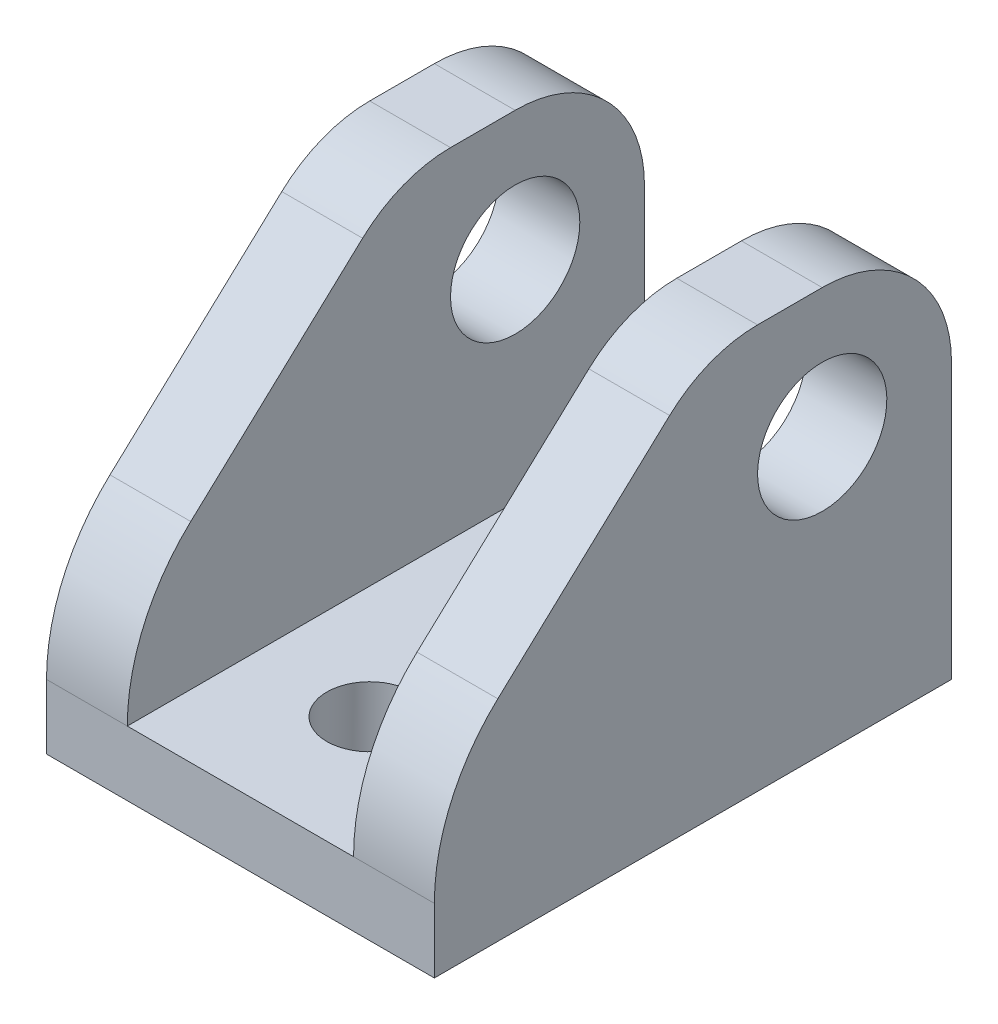
ISO-10303-21;
HEADER;
FILE_DESCRIPTION(('STEP AP214'),'2;1');
FILE_NAME('part.step','',(''),(''),'','','');
FILE_SCHEMA(('AUTOMOTIVE_DESIGN { 1 0 10303 214 1 1 1 1 }'));
ENDSEC;
DATA;
#1=APPLICATION_CONTEXT('core data for automotive mechanical design processes');
#2=APPLICATION_PROTOCOL_DEFINITION('international standard','automotive_design',2000,#1);
#3=PRODUCT_CONTEXT('',#1,'mechanical');
#4=PRODUCT('Part','Part','',(#3));
#5=PRODUCT_RELATED_PRODUCT_CATEGORY('part','',(#4));
#6=PRODUCT_DEFINITION_FORMATION('','',#4);
#7=PRODUCT_DEFINITION_CONTEXT('part definition',#1,'design');
#8=PRODUCT_DEFINITION('design','',#6,#7);
#9=PRODUCT_DEFINITION_SHAPE('','',#8);
#10=(LENGTH_UNIT() NAMED_UNIT(*) SI_UNIT(.MILLI.,.METRE.));
#11=(NAMED_UNIT(*) PLANE_ANGLE_UNIT() SI_UNIT($,.RADIAN.));
#12=(NAMED_UNIT(*) SI_UNIT($,.STERADIAN.) SOLID_ANGLE_UNIT());
#13=UNCERTAINTY_MEASURE_WITH_UNIT(LENGTH_MEASURE(1.E-05),#10,'distance_accuracy_value','');
#14=(GEOMETRIC_REPRESENTATION_CONTEXT(3) GLOBAL_UNCERTAINTY_ASSIGNED_CONTEXT((#13)) GLOBAL_UNIT_ASSIGNED_CONTEXT((#10,
#11,#12)) REPRESENTATION_CONTEXT('',''));
#15=CARTESIAN_POINT('',(0.,0.,0.));
#16=DIRECTION('',(0.,0.,1.));
#17=DIRECTION('',(1.,0.,0.));
#18=AXIS2_PLACEMENT_3D('',#15,#16,#17);
#19=CARTESIAN_POINT('',(0.,0.,50.8));
#20=DIRECTION('',(0.,0.,1.));
#21=DIRECTION('',(1.,0.,0.));
#22=AXIS2_PLACEMENT_3D('',#19,#20,#21);
#23=PLANE('',#22);
#24=DIRECTION('',(0.,1.,0.));
#25=VECTOR('',#24,1.);
#26=CARTESIAN_POINT('',(19.05,0.,50.8));
#27=LINE('',#26,#25);
#28=CARTESIAN_POINT('',(19.05,0.,50.8));
#29=VERTEX_POINT('',#28);
#30=CARTESIAN_POINT('',(19.05,6.35,50.8));
#31=VERTEX_POINT('',#30);
#32=EDGE_CURVE('E162',#29,#31,#27,.T.);
#33=ORIENTED_EDGE('',*,*,#32,.T.);
#34=DIRECTION('',(1.,0.,0.));
#35=VECTOR('',#34,1.);
#36=CARTESIAN_POINT('',(-19.05,6.35,50.8));
#37=LINE('',#36,#35);
#38=CARTESIAN_POINT('',(11.1125,6.35,50.8));
#39=VERTEX_POINT('',#38);
#40=EDGE_CURVE('E142',#31,#39,#37,.F.);
#41=ORIENTED_EDGE('',*,*,#40,.T.);
#42=DIRECTION('',(-1.,0.,0.));
#43=VECTOR('',#42,1.);
#44=CARTESIAN_POINT('',(0.,6.35,50.8));
#45=LINE('',#44,#43);
#46=CARTESIAN_POINT('',(-11.1125,6.35,50.8));
#47=VERTEX_POINT('',#46);
#48=EDGE_CURVE('E195',#39,#47,#45,.T.);
#49=ORIENTED_EDGE('',*,*,#48,.T.);
#50=DIRECTION('',(1.,0.,0.));
#51=VECTOR('',#50,1.);
#52=CARTESIAN_POINT('',(-19.05,6.35,50.8));
#53=LINE('',#52,#51);
#54=CARTESIAN_POINT('',(-19.05,6.35,50.8));
#55=VERTEX_POINT('',#54);
#56=EDGE_CURVE('E272',#55,#47,#53,.T.);
#57=ORIENTED_EDGE('',*,*,#56,.F.);
#58=DIRECTION('',(0.,1.,0.));
#59=VECTOR('',#58,1.);
#60=CARTESIAN_POINT('',(-19.05,0.,50.8));
#61=LINE('',#60,#59);
#62=CARTESIAN_POINT('',(-19.05,0.,50.8));
#63=VERTEX_POINT('',#62);
#64=EDGE_CURVE('E176',#63,#55,#61,.T.);
#65=ORIENTED_EDGE('',*,*,#64,.F.);
#66=DIRECTION('',(1.,0.,0.));
#67=VECTOR('',#66,1.);
#68=CARTESIAN_POINT('',(0.,0.,50.8));
#69=LINE('',#68,#67);
#70=EDGE_CURVE('E169',#63,#29,#69,.T.);
#71=ORIENTED_EDGE('',*,*,#70,.T.);
#72=EDGE_LOOP('',(#33,#41,#49,#57,#65,#71));
#73=FACE_BOUND('',#72,.T.);
#74=ADVANCED_FACE('F35',(#73),#23,.T.);
#75=CARTESIAN_POINT('',(0.,6.35,50.8));
#76=DIRECTION('',(0.,-1.,0.));
#77=DIRECTION('',(1.,0.,0.));
#78=AXIS2_PLACEMENT_3D('',#75,#76,#77);
#79=PLANE('',#78);
#80=CARTESIAN_POINT('',(0.,6.35,38.1));
#81=DIRECTION('',(0.,1.,0.));
#82=DIRECTION('',(0.,0.,1.));
#83=AXIS2_PLACEMENT_3D('',#80,#81,#82);
#84=CIRCLE('',#83,4.2164);
#85=CARTESIAN_POINT('',(0.,6.35,42.3164));
#86=VERTEX_POINT('',#85);
#87=EDGE_CURVE('E240',#86,#86,#84,.T.);
#88=ORIENTED_EDGE('',*,*,#87,.F.);
#89=EDGE_LOOP('',(#88));
#90=FACE_BOUND('',#89,.T.);
#91=CARTESIAN_POINT('',(0.,6.35,12.7));
#92=DIRECTION('',(0.,1.,0.));
#93=DIRECTION('',(0.,0.,1.));
#94=AXIS2_PLACEMENT_3D('',#91,#92,#93);
#95=CIRCLE('',#94,4.2164);
#96=CARTESIAN_POINT('',(0.,6.35,16.9164));
#97=VERTEX_POINT('',#96);
#98=EDGE_CURVE('E246',#97,#97,#95,.T.);
#99=ORIENTED_EDGE('',*,*,#98,.F.);
#100=EDGE_LOOP('',(#99));
#101=FACE_BOUND('',#100,.T.);
#102=DIRECTION('',(-1.,0.,0.));
#103=VECTOR('',#102,1.);
#104=CARTESIAN_POINT('',(0.,6.35,0.));
#105=LINE('',#104,#103);
#106=CARTESIAN_POINT('',(11.1125,6.35,0.));
#107=VERTEX_POINT('',#106);
#108=CARTESIAN_POINT('',(-11.1125,6.35,0.));
#109=VERTEX_POINT('',#108);
#110=EDGE_CURVE('E180',#107,#109,#105,.T.);
#111=ORIENTED_EDGE('',*,*,#110,.T.);
#112=DIRECTION('',(0.,0.,-1.));
#113=VECTOR('',#112,1.);
#114=CARTESIAN_POINT('',(-11.1125,6.35,50.8));
#115=LINE('',#114,#113);
#116=EDGE_CURVE('E200',#47,#109,#115,.T.);
#117=ORIENTED_EDGE('',*,*,#116,.F.);
#118=ORIENTED_EDGE('',*,*,#48,.F.);
#119=DIRECTION('',(0.,0.,-1.));
#120=VECTOR('',#119,1.);
#121=CARTESIAN_POINT('',(11.1125,6.35,50.8));
#122=LINE('',#121,#120);
#123=EDGE_CURVE('E171',#39,#107,#122,.T.);
#124=ORIENTED_EDGE('',*,*,#123,.T.);
#125=EDGE_LOOP('',(#111,#117,#118,#124));
#126=FACE_BOUND('',#125,.T.);
#127=ADVANCED_FACE('F37',(#90,#101,#126),#79,.F.);
#128=CARTESIAN_POINT('',(-11.1125,0.,50.8));
#129=DIRECTION('',(1.,0.,0.));
#130=DIRECTION('',(0.,1.,0.));
#131=AXIS2_PLACEMENT_3D('',#128,#129,#130);
#132=PLANE('',#131);
#133=CARTESIAN_POINT('',(-11.1125,26.9875,12.7));
#134=DIRECTION('',(1.,0.,0.));
#135=DIRECTION('',(0.,1.,0.));
#136=AXIS2_PLACEMENT_3D('',#133,#134,#135);
#137=CIRCLE('',#136,6.35);
#138=CARTESIAN_POINT('',(-11.1125,33.3375,12.7));
#139=VERTEX_POINT('',#138);
#140=EDGE_CURVE('E255',#139,#139,#137,.T.);
#141=ORIENTED_EDGE('',*,*,#140,.F.);
#142=EDGE_LOOP('',(#141));
#143=FACE_BOUND('',#142,.T.);
#144=DIRECTION('',(0.,-1.,0.));
#145=VECTOR('',#144,1.);
#146=CARTESIAN_POINT('',(-11.1125,0.,0.));
#147=LINE('',#146,#145);
#148=CARTESIAN_POINT('',(-11.1125,26.9875,0.));
#149=VERTEX_POINT('',#148);
#150=EDGE_CURVE('E183',#149,#109,#147,.T.);
#151=ORIENTED_EDGE('',*,*,#150,.F.);
#152=CARTESIAN_POINT('',(-11.1125,26.9875,12.7));
#153=DIRECTION('',(1.,0.,0.));
#154=DIRECTION('',(0.,1.,0.));
#155=AXIS2_PLACEMENT_3D('',#152,#153,#154);
#156=CIRCLE('',#155,12.7);
#157=CARTESIAN_POINT('',(-11.1125,39.6875,12.7));
#158=VERTEX_POINT('',#157);
#159=EDGE_CURVE('E50',#149,#158,#156,.T.);
#160=ORIENTED_EDGE('',*,*,#159,.T.);
#161=DIRECTION('',(0.,0.,1.));
#162=VECTOR('',#161,1.);
#163=CARTESIAN_POINT('',(-11.1125,39.6875,50.8));
#164=LINE('',#163,#162);
#165=CARTESIAN_POINT('',(-11.1125,39.6875,19.05));
#166=VERTEX_POINT('',#165);
#167=EDGE_CURVE('E237',#158,#166,#164,.T.);
#168=ORIENTED_EDGE('',*,*,#167,.T.);
#169=CARTESIAN_POINT('',(-11.1125,26.9875,19.05));
#170=DIRECTION('',(1.,0.,0.));
#171=DIRECTION('',(0.,1.,0.));
#172=AXIS2_PLACEMENT_3D('',#169,#170,#171);
#173=CIRCLE('',#172,12.7);
#174=CARTESIAN_POINT('',(-11.1125,36.2974683520341,27.6879678908945));
#175=VERTEX_POINT('',#174);
#176=EDGE_CURVE('E234',#166,#175,#173,.T.);
#177=ORIENTED_EDGE('',*,*,#176,.T.);
#178=DIRECTION('',(0.,-0.680154952038938,0.733068374175909));
#179=VECTOR('',#178,1.);
#180=CARTESIAN_POINT('',(-11.1125,7.98220780447106,58.2060460902001));
#181=LINE('',#180,#179);
#182=CARTESIAN_POINT('',(-11.1125,20.6375,44.5662211551809));
#183=VERTEX_POINT('',#182);
#184=EDGE_CURVE('E226',#175,#183,#181,.T.);
#185=ORIENTED_EDGE('',*,*,#184,.T.);
#186=CARTESIAN_POINT('',(-11.1125,6.35,31.3100035640447));
#187=DIRECTION('',(1.,0.,0.));
#188=DIRECTION('',(0.,1.,0.));
#189=AXIS2_PLACEMENT_3D('',#186,#187,#188);
#190=CIRCLE('',#189,19.4899964359553);
#191=EDGE_CURVE('E224',#47,#183,#190,.F.);
#192=ORIENTED_EDGE('',*,*,#191,.F.);
#193=ORIENTED_EDGE('',*,*,#116,.T.);
#194=EDGE_LOOP('',(#151,#160,#168,#177,#185,#192,#193));
#195=FACE_BOUND('',#194,.T.);
#196=ADVANCED_FACE('F325',(#143,#195),#132,.T.);
#197=CARTESIAN_POINT('',(-19.05,0.,50.8));
#198=DIRECTION('',(-1.,0.,0.));
#199=DIRECTION('',(0.,-1.,0.));
#200=AXIS2_PLACEMENT_3D('',#197,#198,#199);
#201=PLANE('',#200);
#202=CARTESIAN_POINT('',(-19.05,26.9875,12.7));
#203=DIRECTION('',(-1.,0.,0.));
#204=DIRECTION('',(0.,-1.,0.));
#205=AXIS2_PLACEMENT_3D('',#202,#203,#204);
#206=CIRCLE('',#205,6.35);
#207=CARTESIAN_POINT('',(-19.05,20.6375,12.7));
#208=VERTEX_POINT('',#207);
#209=EDGE_CURVE('E184',#208,#208,#206,.T.);
#210=ORIENTED_EDGE('',*,*,#209,.F.);
#211=EDGE_LOOP('',(#210));
#212=FACE_BOUND('',#211,.T.);
#213=DIRECTION('',(0.,0.,1.));
#214=VECTOR('',#213,1.);
#215=CARTESIAN_POINT('',(-19.05,39.6875,0.));
#216=LINE('',#215,#214);
#217=CARTESIAN_POINT('',(-19.05,39.6875,12.7));
#218=VERTEX_POINT('',#217);
#219=CARTESIAN_POINT('',(-19.05,39.6875,19.05));
#220=VERTEX_POINT('',#219);
#221=EDGE_CURVE('E280',#218,#220,#216,.T.);
#222=ORIENTED_EDGE('',*,*,#221,.F.);
#223=CARTESIAN_POINT('',(-19.05,26.9875,12.7));
#224=DIRECTION('',(1.,0.,0.));
#225=DIRECTION('',(0.,0.,-1.));
#226=AXIS2_PLACEMENT_3D('',#223,#224,#225);
#227=CIRCLE('',#226,12.7);
#228=CARTESIAN_POINT('',(-19.05,26.9875,0.));
#229=VERTEX_POINT('',#228);
#230=EDGE_CURVE('E277',#229,#218,#227,.T.);
#231=ORIENTED_EDGE('',*,*,#230,.F.);
#232=DIRECTION('',(0.,1.,0.));
#233=VECTOR('',#232,1.);
#234=CARTESIAN_POINT('',(-19.05,0.,0.));
#235=LINE('',#234,#233);
#236=CARTESIAN_POINT('',(-19.05,0.,0.));
#237=VERTEX_POINT('',#236);
#238=EDGE_CURVE('E186',#237,#229,#235,.T.);
#239=ORIENTED_EDGE('',*,*,#238,.F.);
#240=DIRECTION('',(0.,0.,-1.));
#241=VECTOR('',#240,1.);
#242=CARTESIAN_POINT('',(-19.05,0.,50.8));
#243=LINE('',#242,#241);
#244=EDGE_CURVE('E198',#63,#237,#243,.T.);
#245=ORIENTED_EDGE('',*,*,#244,.F.);
#246=ORIENTED_EDGE('',*,*,#64,.T.);
#247=CARTESIAN_POINT('',(-19.05,6.35,31.3100035640447));
#248=DIRECTION('',(1.,0.,0.));
#249=DIRECTION('',(0.,0.,-1.));
#250=AXIS2_PLACEMENT_3D('',#247,#248,#249);
#251=CIRCLE('',#250,19.4899964359553);
#252=CARTESIAN_POINT('',(-19.05,20.6375,44.5662211551809));
#253=VERTEX_POINT('',#252);
#254=EDGE_CURVE('E269',#55,#253,#251,.F.);
#255=ORIENTED_EDGE('',*,*,#254,.T.);
#256=DIRECTION('',(0.,-0.680154952038938,0.733068374175909));
#257=VECTOR('',#256,1.);
#258=CARTESIAN_POINT('',(-19.05,33.311092116318,30.9066726363811));
#259=LINE('',#258,#257);
#260=CARTESIAN_POINT('',(-19.05,36.2974683520341,27.6879678908945));
#261=VERTEX_POINT('',#260);
#262=EDGE_CURVE('E309',#261,#253,#259,.T.);
#263=ORIENTED_EDGE('',*,*,#262,.F.);
#264=CARTESIAN_POINT('',(-19.05,26.9875,19.05));
#265=DIRECTION('',(1.,0.,0.));
#266=DIRECTION('',(0.,0.,-1.));
#267=AXIS2_PLACEMENT_3D('',#264,#265,#266);
#268=CIRCLE('',#267,12.7);
#269=EDGE_CURVE('E311',#220,#261,#268,.T.);
#270=ORIENTED_EDGE('',*,*,#269,.F.);
#271=EDGE_LOOP('',(#222,#231,#239,#245,#246,#255,#263,#270));
#272=FACE_BOUND('',#271,.T.);
#273=ADVANCED_FACE('F267',(#212,#272),#201,.T.);
#274=CARTESIAN_POINT('',(0.,0.,50.8));
#275=DIRECTION('',(0.,1.,0.));
#276=DIRECTION('',(-1.,0.,0.));
#277=AXIS2_PLACEMENT_3D('',#274,#275,#276);
#278=PLANE('',#277);
#279=CARTESIAN_POINT('',(0.,0.,38.1));
#280=DIRECTION('',(0.,1.,0.));
#281=DIRECTION('',(-1.,0.,0.));
#282=AXIS2_PLACEMENT_3D('',#279,#280,#281);
#283=CIRCLE('',#282,4.2164);
#284=CARTESIAN_POINT('',(-4.21639999999999,0.,38.1));
#285=VERTEX_POINT('',#284);
#286=EDGE_CURVE('E243',#285,#285,#283,.T.);
#287=ORIENTED_EDGE('',*,*,#286,.T.);
#288=EDGE_LOOP('',(#287));
#289=FACE_BOUND('',#288,.T.);
#290=CARTESIAN_POINT('',(0.,0.,12.7));
#291=DIRECTION('',(0.,1.,0.));
#292=DIRECTION('',(-1.,0.,0.));
#293=AXIS2_PLACEMENT_3D('',#290,#291,#292);
#294=CIRCLE('',#293,4.2164);
#295=CARTESIAN_POINT('',(-4.2164,0.,12.7));
#296=VERTEX_POINT('',#295);
#297=EDGE_CURVE('E249',#296,#296,#294,.T.);
#298=ORIENTED_EDGE('',*,*,#297,.T.);
#299=EDGE_LOOP('',(#298));
#300=FACE_BOUND('',#299,.T.);
#301=DIRECTION('',(1.,0.,0.));
#302=VECTOR('',#301,1.);
#303=CARTESIAN_POINT('',(0.,0.,0.));
#304=LINE('',#303,#302);
#305=CARTESIAN_POINT('',(19.05,0.,0.));
#306=VERTEX_POINT('',#305);
#307=EDGE_CURVE('E189',#237,#306,#304,.T.);
#308=ORIENTED_EDGE('',*,*,#307,.T.);
#309=DIRECTION('',(0.,0.,-1.));
#310=VECTOR('',#309,1.);
#311=CARTESIAN_POINT('',(19.05,0.,50.8));
#312=LINE('',#311,#310);
#313=EDGE_CURVE('E174',#29,#306,#312,.T.);
#314=ORIENTED_EDGE('',*,*,#313,.F.);
#315=ORIENTED_EDGE('',*,*,#70,.F.);
#316=ORIENTED_EDGE('',*,*,#244,.T.);
#317=EDGE_LOOP('',(#308,#314,#315,#316));
#318=FACE_BOUND('',#317,.T.);
#319=ADVANCED_FACE('F331',(#289,#300,#318),#278,.F.);
#320=CARTESIAN_POINT('',(19.05,0.,50.8));
#321=DIRECTION('',(-1.,0.,0.));
#322=DIRECTION('',(0.,-1.,0.));
#323=AXIS2_PLACEMENT_3D('',#320,#321,#322);
#324=PLANE('',#323);
#325=CARTESIAN_POINT('',(19.05,26.9875,12.7));
#326=DIRECTION('',(1.,0.,0.));
#327=DIRECTION('',(0.,0.,-1.));
#328=AXIS2_PLACEMENT_3D('',#325,#326,#327);
#329=CIRCLE('',#328,12.7);
#330=CARTESIAN_POINT('',(19.05,26.9875,0.));
#331=VERTEX_POINT('',#330);
#332=CARTESIAN_POINT('',(19.05,39.6875,12.7));
#333=VERTEX_POINT('',#332);
#334=EDGE_CURVE('E58',#331,#333,#329,.T.);
#335=ORIENTED_EDGE('',*,*,#334,.T.);
#336=DIRECTION('',(0.,0.,1.));
#337=VECTOR('',#336,1.);
#338=CARTESIAN_POINT('',(19.05,39.6875,0.));
#339=LINE('',#338,#337);
#340=CARTESIAN_POINT('',(19.05,39.6875,19.05));
#341=VERTEX_POINT('',#340);
#342=EDGE_CURVE('E301',#333,#341,#339,.T.);
#343=ORIENTED_EDGE('',*,*,#342,.T.);
#344=CARTESIAN_POINT('',(19.05,26.9875,19.05));
#345=DIRECTION('',(1.,0.,0.));
#346=DIRECTION('',(0.,0.,-1.));
#347=AXIS2_PLACEMENT_3D('',#344,#345,#346);
#348=CIRCLE('',#347,12.7);
#349=CARTESIAN_POINT('',(19.05,36.2974683520341,27.6879678908945));
#350=VERTEX_POINT('',#349);
#351=EDGE_CURVE('E302',#341,#350,#348,.T.);
#352=ORIENTED_EDGE('',*,*,#351,.T.);
#353=DIRECTION('',(0.,-0.680154952038938,0.733068374175909));
#354=VECTOR('',#353,1.);
#355=CARTESIAN_POINT('',(19.05,33.311092116318,30.9066726363811));
#356=LINE('',#355,#354);
#357=CARTESIAN_POINT('',(19.05,20.6375,44.5662211551809));
#358=VERTEX_POINT('',#357);
#359=EDGE_CURVE('E165',#350,#358,#356,.T.);
#360=ORIENTED_EDGE('',*,*,#359,.T.);
#361=CARTESIAN_POINT('',(19.05,6.35,31.3100035640447));
#362=DIRECTION('',(1.,0.,0.));
#363=DIRECTION('',(0.,0.,-1.));
#364=AXIS2_PLACEMENT_3D('',#361,#362,#363);
#365=CIRCLE('',#364,19.4899964359553);
#366=EDGE_CURVE('E146',#31,#358,#365,.F.);
#367=ORIENTED_EDGE('',*,*,#366,.F.);
#368=ORIENTED_EDGE('',*,*,#32,.F.);
#369=ORIENTED_EDGE('',*,*,#313,.T.);
#370=DIRECTION('',(0.,1.,0.));
#371=VECTOR('',#370,1.);
#372=CARTESIAN_POINT('',(19.05,0.,0.));
#373=LINE('',#372,#371);
#374=EDGE_CURVE('E191',#306,#331,#373,.T.);
#375=ORIENTED_EDGE('',*,*,#374,.T.);
#376=EDGE_LOOP('',(#335,#343,#352,#360,#367,#368,#369,#375));
#377=FACE_BOUND('',#376,.T.);
#378=CARTESIAN_POINT('',(19.05,26.9875,12.7));
#379=DIRECTION('',(-1.,0.,0.));
#380=DIRECTION('',(0.,-1.,0.));
#381=AXIS2_PLACEMENT_3D('',#378,#379,#380);
#382=CIRCLE('',#381,6.35);
#383=CARTESIAN_POINT('',(19.05,20.6375,12.7));
#384=VERTEX_POINT('',#383);
#385=EDGE_CURVE('E258',#384,#384,#382,.T.);
#386=ORIENTED_EDGE('',*,*,#385,.T.);
#387=EDGE_LOOP('',(#386));
#388=FACE_BOUND('',#387,.T.);
#389=ADVANCED_FACE('F159',(#377,#388),#324,.F.);
#390=CARTESIAN_POINT('',(11.1125,0.,50.8));
#391=DIRECTION('',(1.,0.,0.));
#392=DIRECTION('',(0.,1.,0.));
#393=AXIS2_PLACEMENT_3D('',#390,#391,#392);
#394=PLANE('',#393);
#395=CARTESIAN_POINT('',(11.1125,26.9875,12.7));
#396=DIRECTION('',(1.,0.,0.));
#397=DIRECTION('',(0.,1.,0.));
#398=AXIS2_PLACEMENT_3D('',#395,#396,#397);
#399=CIRCLE('',#398,12.7);
#400=CARTESIAN_POINT('',(11.1125,26.9875,0.));
#401=VERTEX_POINT('',#400);
#402=CARTESIAN_POINT('',(11.1125,39.6875,12.7));
#403=VERTEX_POINT('',#402);
#404=EDGE_CURVE('E228',#401,#403,#399,.T.);
#405=ORIENTED_EDGE('',*,*,#404,.F.);
#406=DIRECTION('',(0.,-1.,0.));
#407=VECTOR('',#406,1.);
#408=CARTESIAN_POINT('',(11.1125,0.,0.));
#409=LINE('',#408,#407);
#410=EDGE_CURVE('E194',#401,#107,#409,.T.);
#411=ORIENTED_EDGE('',*,*,#410,.T.);
#412=ORIENTED_EDGE('',*,*,#123,.F.);
#413=CARTESIAN_POINT('',(11.1125,6.35,31.3100035640447));
#414=DIRECTION('',(1.,0.,0.));
#415=DIRECTION('',(0.,1.,0.));
#416=AXIS2_PLACEMENT_3D('',#413,#414,#415);
#417=CIRCLE('',#416,19.4899964359553);
#418=CARTESIAN_POINT('',(11.1125,20.6375,44.5662211551809));
#419=VERTEX_POINT('',#418);
#420=EDGE_CURVE('E149',#39,#419,#417,.F.);
#421=ORIENTED_EDGE('',*,*,#420,.T.);
#422=DIRECTION('',(0.,-0.680154952038938,0.733068374175909));
#423=VECTOR('',#422,1.);
#424=CARTESIAN_POINT('',(11.1125,7.98220780447106,58.2060460902001));
#425=LINE('',#424,#423);
#426=CARTESIAN_POINT('',(11.1125,36.2974683520341,27.6879678908945));
#427=VERTEX_POINT('',#426);
#428=EDGE_CURVE('E154',#427,#419,#425,.T.);
#429=ORIENTED_EDGE('',*,*,#428,.F.);
#430=CARTESIAN_POINT('',(11.1125,26.9875,19.05));
#431=DIRECTION('',(1.,0.,0.));
#432=DIRECTION('',(0.,1.,0.));
#433=AXIS2_PLACEMENT_3D('',#430,#431,#432);
#434=CIRCLE('',#433,12.7);
#435=CARTESIAN_POINT('',(11.1125,39.6875,19.05));
#436=VERTEX_POINT('',#435);
#437=EDGE_CURVE('E43',#436,#427,#434,.T.);
#438=ORIENTED_EDGE('',*,*,#437,.F.);
#439=DIRECTION('',(0.,0.,1.));
#440=VECTOR('',#439,1.);
#441=CARTESIAN_POINT('',(11.1125,39.6875,50.8));
#442=LINE('',#441,#440);
#443=EDGE_CURVE('E12',#403,#436,#442,.T.);
#444=ORIENTED_EDGE('',*,*,#443,.F.);
#445=EDGE_LOOP('',(#405,#411,#412,#421,#429,#438,#444));
#446=FACE_BOUND('',#445,.T.);
#447=CARTESIAN_POINT('',(11.1125,26.9875,12.7));
#448=DIRECTION('',(1.,0.,0.));
#449=DIRECTION('',(0.,1.,0.));
#450=AXIS2_PLACEMENT_3D('',#447,#448,#449);
#451=CIRCLE('',#450,6.35);
#452=CARTESIAN_POINT('',(11.1125,33.3375,12.7));
#453=VERTEX_POINT('',#452);
#454=EDGE_CURVE('E252',#453,#453,#451,.T.);
#455=ORIENTED_EDGE('',*,*,#454,.T.);
#456=EDGE_LOOP('',(#455));
#457=FACE_BOUND('',#456,.T.);
#458=ADVANCED_FACE('F221',(#446,#457),#394,.F.);
#459=CARTESIAN_POINT('',(0.,0.,0.));
#460=DIRECTION('',(0.,0.,1.));
#461=DIRECTION('',(1.,0.,0.));
#462=AXIS2_PLACEMENT_3D('',#459,#460,#461);
#463=PLANE('',#462);
#464=ORIENTED_EDGE('',*,*,#238,.T.);
#465=DIRECTION('',(1.,0.,0.));
#466=VECTOR('',#465,1.);
#467=CARTESIAN_POINT('',(-19.05,26.9875,0.));
#468=LINE('',#467,#466);
#469=EDGE_CURVE('E282',#229,#149,#468,.T.);
#470=ORIENTED_EDGE('',*,*,#469,.T.);
#471=ORIENTED_EDGE('',*,*,#150,.T.);
#472=ORIENTED_EDGE('',*,*,#110,.F.);
#473=ORIENTED_EDGE('',*,*,#410,.F.);
#474=DIRECTION('',(1.,0.,0.));
#475=VECTOR('',#474,1.);
#476=CARTESIAN_POINT('',(-19.05,26.9875,0.));
#477=LINE('',#476,#475);
#478=EDGE_CURVE('E155',#401,#331,#477,.T.);
#479=ORIENTED_EDGE('',*,*,#478,.T.);
#480=ORIENTED_EDGE('',*,*,#374,.F.);
#481=ORIENTED_EDGE('',*,*,#307,.F.);
#482=EDGE_LOOP('',(#464,#470,#471,#472,#473,#479,#480,#481));
#483=FACE_BOUND('',#482,.T.);
#484=ADVANCED_FACE('F328',(#483),#463,.F.);
#485=CARTESIAN_POINT('',(-15.875,26.9875,12.7));
#486=DIRECTION('',(-1.,0.,0.));
#487=DIRECTION('',(0.,0.,1.));
#488=AXIS2_PLACEMENT_3D('',#485,#486,#487);
#489=CYLINDRICAL_SURFACE('',#488,6.35);
#490=ORIENTED_EDGE('',*,*,#209,.T.);
#491=EDGE_LOOP('',(#490));
#492=FACE_BOUND('',#491,.T.);
#493=ORIENTED_EDGE('',*,*,#140,.T.);
#494=EDGE_LOOP('',(#493));
#495=FACE_BOUND('',#494,.T.);
#496=ADVANCED_FACE('F354',(#492,#495),#489,.F.);
#497=CARTESIAN_POINT('',(15.875,26.9875,12.7));
#498=DIRECTION('',(1.,0.,0.));
#499=DIRECTION('',(0.,0.,1.));
#500=AXIS2_PLACEMENT_3D('',#497,#498,#499);
#501=CYLINDRICAL_SURFACE('',#500,6.35);
#502=ORIENTED_EDGE('',*,*,#385,.F.);
#503=EDGE_LOOP('',(#502));
#504=FACE_BOUND('',#503,.T.);
#505=ORIENTED_EDGE('',*,*,#454,.F.);
#506=EDGE_LOOP('',(#505));
#507=FACE_BOUND('',#506,.T.);
#508=ADVANCED_FACE('F453',(#504,#507),#501,.F.);
#509=CARTESIAN_POINT('',(0.,6.35,12.7));
#510=DIRECTION('',(0.,1.,0.));
#511=DIRECTION('',(0.,0.,1.));
#512=AXIS2_PLACEMENT_3D('',#509,#510,#511);
#513=CYLINDRICAL_SURFACE('',#512,4.2164);
#514=ORIENTED_EDGE('',*,*,#98,.T.);
#515=EDGE_LOOP('',(#514));
#516=FACE_BOUND('',#515,.T.);
#517=ORIENTED_EDGE('',*,*,#297,.F.);
#518=EDGE_LOOP('',(#517));
#519=FACE_BOUND('',#518,.T.);
#520=ADVANCED_FACE('F450',(#516,#519),#513,.F.);
#521=CARTESIAN_POINT('',(0.,6.35,38.1));
#522=DIRECTION('',(0.,1.,0.));
#523=DIRECTION('',(0.,0.,1.));
#524=AXIS2_PLACEMENT_3D('',#521,#522,#523);
#525=CYLINDRICAL_SURFACE('',#524,4.2164);
#526=ORIENTED_EDGE('',*,*,#87,.T.);
#527=EDGE_LOOP('',(#526));
#528=FACE_BOUND('',#527,.T.);
#529=ORIENTED_EDGE('',*,*,#286,.F.);
#530=EDGE_LOOP('',(#529));
#531=FACE_BOUND('',#530,.T.);
#532=ADVANCED_FACE('F374',(#528,#531),#525,.F.);
#533=CARTESIAN_POINT('',(-19.05,6.35,31.3100035640447));
#534=DIRECTION('',(1.,0.,0.));
#535=DIRECTION('',(0.,0.,-1.));
#536=AXIS2_PLACEMENT_3D('',#533,#534,#535);
#537=CYLINDRICAL_SURFACE('',#536,19.4899964359553);
#538=ORIENTED_EDGE('',*,*,#40,.F.);
#539=ORIENTED_EDGE('',*,*,#366,.T.);
#540=DIRECTION('',(1.,0.,0.));
#541=VECTOR('',#540,1.);
#542=CARTESIAN_POINT('',(-19.05,20.6375,44.5662211551809));
#543=LINE('',#542,#541);
#544=EDGE_CURVE('E276',#419,#358,#543,.T.);
#545=ORIENTED_EDGE('',*,*,#544,.F.);
#546=ORIENTED_EDGE('',*,*,#420,.F.);
#547=EDGE_LOOP('',(#538,#539,#545,#546));
#548=FACE_BOUND('',#547,.T.);
#549=ADVANCED_FACE('F144',(#548),#537,.T.);
#550=CARTESIAN_POINT('',(-19.05,33.311092116318,30.9066726363811));
#551=DIRECTION('',(0.,0.733068374175909,0.680154952038938));
#552=DIRECTION('',(0.,-0.680154952038938,0.733068374175909));
#553=AXIS2_PLACEMENT_3D('',#550,#551,#552);
#554=PLANE('',#553);
#555=ORIENTED_EDGE('',*,*,#428,.T.);
#556=ORIENTED_EDGE('',*,*,#544,.T.);
#557=ORIENTED_EDGE('',*,*,#359,.F.);
#558=DIRECTION('',(1.,0.,0.));
#559=VECTOR('',#558,1.);
#560=CARTESIAN_POINT('',(-19.05,36.2974683520341,27.6879678908945));
#561=LINE('',#560,#559);
#562=EDGE_CURVE('E210',#427,#350,#561,.T.);
#563=ORIENTED_EDGE('',*,*,#562,.F.);
#564=EDGE_LOOP('',(#555,#556,#557,#563));
#565=FACE_BOUND('',#564,.T.);
#566=ADVANCED_FACE('F216',(#565),#554,.T.);
#567=CARTESIAN_POINT('',(-19.05,26.9875,19.05));
#568=DIRECTION('',(1.,0.,0.));
#569=DIRECTION('',(0.,0.,-1.));
#570=AXIS2_PLACEMENT_3D('',#567,#568,#569);
#571=CYLINDRICAL_SURFACE('',#570,12.7);
#572=ORIENTED_EDGE('',*,*,#437,.T.);
#573=ORIENTED_EDGE('',*,*,#562,.T.);
#574=ORIENTED_EDGE('',*,*,#351,.F.);
#575=DIRECTION('',(1.,0.,0.));
#576=VECTOR('',#575,1.);
#577=CARTESIAN_POINT('',(-19.05,39.6875,19.05));
#578=LINE('',#577,#576);
#579=EDGE_CURVE('E211',#436,#341,#578,.T.);
#580=ORIENTED_EDGE('',*,*,#579,.F.);
#581=EDGE_LOOP('',(#572,#573,#574,#580));
#582=FACE_BOUND('',#581,.T.);
#583=ADVANCED_FACE('F208',(#582),#571,.T.);
#584=CARTESIAN_POINT('',(-19.05,26.9875,12.7));
#585=DIRECTION('',(1.,0.,0.));
#586=DIRECTION('',(0.,0.,-1.));
#587=AXIS2_PLACEMENT_3D('',#584,#585,#586);
#588=CYLINDRICAL_SURFACE('',#587,12.7);
#589=ORIENTED_EDGE('',*,*,#404,.T.);
#590=DIRECTION('',(1.,0.,0.));
#591=VECTOR('',#590,1.);
#592=CARTESIAN_POINT('',(-19.05,39.6875,12.7));
#593=LINE('',#592,#591);
#594=EDGE_CURVE('E288',#403,#333,#593,.T.);
#595=ORIENTED_EDGE('',*,*,#594,.T.);
#596=ORIENTED_EDGE('',*,*,#334,.F.);
#597=ORIENTED_EDGE('',*,*,#478,.F.);
#598=EDGE_LOOP('',(#589,#595,#596,#597));
#599=FACE_BOUND('',#598,.T.);
#600=ADVANCED_FACE('F392',(#599),#588,.T.);
#601=CARTESIAN_POINT('',(-19.05,39.6875,0.));
#602=DIRECTION('',(0.,1.,0.));
#603=DIRECTION('',(0.,0.,1.));
#604=AXIS2_PLACEMENT_3D('',#601,#602,#603);
#605=PLANE('',#604);
#606=ORIENTED_EDGE('',*,*,#443,.T.);
#607=ORIENTED_EDGE('',*,*,#579,.T.);
#608=ORIENTED_EDGE('',*,*,#342,.F.);
#609=ORIENTED_EDGE('',*,*,#594,.F.);
#610=EDGE_LOOP('',(#606,#607,#608,#609));
#611=FACE_BOUND('',#610,.T.);
#612=ADVANCED_FACE('F299',(#611),#605,.T.);
#613=ORIENTED_EDGE('',*,*,#469,.F.);
#614=ORIENTED_EDGE('',*,*,#230,.T.);
#615=EDGE_CURVE('E284',#218,#158,#593,.T.);
#616=ORIENTED_EDGE('',*,*,#615,.T.);
#617=ORIENTED_EDGE('',*,*,#159,.F.);
#618=EDGE_LOOP('',(#613,#614,#616,#617));
#619=FACE_BOUND('',#618,.T.);
#620=ADVANCED_FACE('F326',(#619),#588,.T.);
#621=ORIENTED_EDGE('',*,*,#615,.F.);
#622=ORIENTED_EDGE('',*,*,#221,.T.);
#623=EDGE_CURVE('E292',#220,#166,#578,.T.);
#624=ORIENTED_EDGE('',*,*,#623,.T.);
#625=ORIENTED_EDGE('',*,*,#167,.F.);
#626=EDGE_LOOP('',(#621,#622,#624,#625));
#627=FACE_BOUND('',#626,.T.);
#628=ADVANCED_FACE('F315',(#627),#605,.T.);
#629=ORIENTED_EDGE('',*,*,#623,.F.);
#630=ORIENTED_EDGE('',*,*,#269,.T.);
#631=EDGE_CURVE('E217',#261,#175,#561,.T.);
#632=ORIENTED_EDGE('',*,*,#631,.T.);
#633=ORIENTED_EDGE('',*,*,#176,.F.);
#634=EDGE_LOOP('',(#629,#630,#632,#633));
#635=FACE_BOUND('',#634,.T.);
#636=ADVANCED_FACE('F318',(#635),#571,.T.);
#637=ORIENTED_EDGE('',*,*,#631,.F.);
#638=ORIENTED_EDGE('',*,*,#262,.T.);
#639=EDGE_CURVE('E218',#253,#183,#543,.T.);
#640=ORIENTED_EDGE('',*,*,#639,.T.);
#641=ORIENTED_EDGE('',*,*,#184,.F.);
#642=EDGE_LOOP('',(#637,#638,#640,#641));
#643=FACE_BOUND('',#642,.T.);
#644=ADVANCED_FACE('F322',(#643),#554,.T.);
#645=ORIENTED_EDGE('',*,*,#191,.T.);
#646=ORIENTED_EDGE('',*,*,#639,.F.);
#647=ORIENTED_EDGE('',*,*,#254,.F.);
#648=ORIENTED_EDGE('',*,*,#56,.T.);
#649=EDGE_LOOP('',(#645,#646,#647,#648));
#650=FACE_BOUND('',#649,.T.);
#651=ADVANCED_FACE('F323',(#650),#537,.T.);
#652=CLOSED_SHELL('',(#74,#127,#196,#273,#319,#389,#458,#484,#496,#508,#520,#532,#549,#566,#583,
#600,#612,#620,#628,#636,#644,#651));
#653=MANIFOLD_SOLID_BREP('B2',#652);
#654=ADVANCED_BREP_SHAPE_REPRESENTATION('',(#18,#653),#14);
#655=SHAPE_DEFINITION_REPRESENTATION(#9,#654);
ENDSEC;
END-ISO-10303-21;
